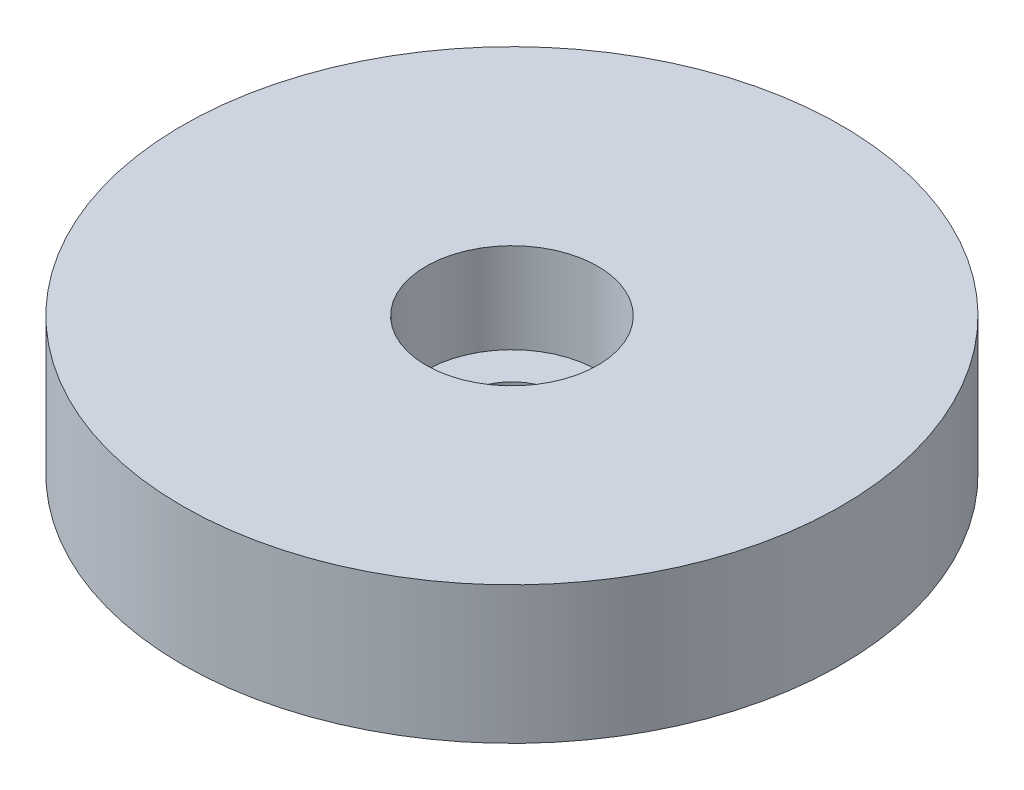
ISO-10303-21;
HEADER;
FILE_DESCRIPTION(('STEP AP214'),'2;1');
FILE_NAME('part.step','',(''),(''),'','','');
FILE_SCHEMA(('AUTOMOTIVE_DESIGN { 1 0 10303 214 1 1 1 1 }'));
ENDSEC;
DATA;
#1=APPLICATION_CONTEXT('core data for automotive mechanical design processes');
#2=APPLICATION_PROTOCOL_DEFINITION('international standard','automotive_design',2000,#1);
#3=PRODUCT_CONTEXT('',#1,'mechanical');
#4=PRODUCT('Part','Part','',(#3));
#5=PRODUCT_RELATED_PRODUCT_CATEGORY('part','',(#4));
#6=PRODUCT_DEFINITION_FORMATION('','',#4);
#7=PRODUCT_DEFINITION_CONTEXT('part definition',#1,'design');
#8=PRODUCT_DEFINITION('design','',#6,#7);
#9=PRODUCT_DEFINITION_SHAPE('','',#8);
#10=(LENGTH_UNIT() NAMED_UNIT(*) SI_UNIT(.MILLI.,.METRE.));
#11=(NAMED_UNIT(*) PLANE_ANGLE_UNIT() SI_UNIT($,.RADIAN.));
#12=(NAMED_UNIT(*) SI_UNIT($,.STERADIAN.) SOLID_ANGLE_UNIT());
#13=UNCERTAINTY_MEASURE_WITH_UNIT(LENGTH_MEASURE(1.E-05),#10,'distance_accuracy_value','');
#14=(GEOMETRIC_REPRESENTATION_CONTEXT(3) GLOBAL_UNCERTAINTY_ASSIGNED_CONTEXT((#13)) GLOBAL_UNIT_ASSIGNED_CONTEXT((#10,
#11,#12)) REPRESENTATION_CONTEXT('',''));
#15=CARTESIAN_POINT('',(0.,0.,0.));
#16=DIRECTION('',(0.,0.,1.));
#17=DIRECTION('',(1.,0.,0.));
#18=AXIS2_PLACEMENT_3D('',#15,#16,#17);
#19=CARTESIAN_POINT('',(0.,6.35,0.));
#20=DIRECTION('',(0.,-1.,0.));
#21=DIRECTION('',(0.,0.,-1.));
#22=AXIS2_PLACEMENT_3D('',#19,#20,#21);
#23=CYLINDRICAL_SURFACE('',#22,15.24);
#24=CARTESIAN_POINT('',(0.,6.35,0.));
#25=DIRECTION('',(0.,1.,0.));
#26=DIRECTION('',(0.,0.,1.));
#27=AXIS2_PLACEMENT_3D('',#24,#25,#26);
#28=CIRCLE('',#27,15.24);
#29=CARTESIAN_POINT('',(0.,6.35,15.24));
#30=VERTEX_POINT('',#29);
#31=EDGE_CURVE('E10',#30,#30,#28,.T.);
#32=ORIENTED_EDGE('',*,*,#31,.F.);
#33=EDGE_LOOP('',(#32));
#34=FACE_BOUND('',#33,.T.);
#35=CARTESIAN_POINT('',(0.,0.,0.));
#36=DIRECTION('',(0.,1.,0.));
#37=DIRECTION('',(0.,0.,1.));
#38=AXIS2_PLACEMENT_3D('',#35,#36,#37);
#39=CIRCLE('',#38,15.24);
#40=CARTESIAN_POINT('',(0.,0.,15.24));
#41=VERTEX_POINT('',#40);
#42=EDGE_CURVE('E33',#41,#41,#39,.T.);
#43=ORIENTED_EDGE('',*,*,#42,.T.);
#44=EDGE_LOOP('',(#43));
#45=FACE_BOUND('',#44,.T.);
#46=ADVANCED_FACE('F30',(#34,#45),#23,.T.);
#47=CARTESIAN_POINT('',(0.,6.35,0.));
#48=DIRECTION('',(0.,1.,0.));
#49=DIRECTION('',(0.,0.,1.));
#50=AXIS2_PLACEMENT_3D('',#47,#48,#49);
#51=PLANE('',#50);
#52=CARTESIAN_POINT('',(0.,6.35,0.));
#53=DIRECTION('',(0.,1.,0.));
#54=DIRECTION('',(0.,0.,1.));
#55=AXIS2_PLACEMENT_3D('',#52,#53,#54);
#56=CIRCLE('',#55,3.96875);
#57=CARTESIAN_POINT('',(0.,6.35,3.96875));
#58=VERTEX_POINT('',#57);
#59=EDGE_CURVE('E50',#58,#58,#56,.T.);
#60=ORIENTED_EDGE('',*,*,#59,.F.);
#61=EDGE_LOOP('',(#60));
#62=FACE_BOUND('',#61,.T.);
#63=ORIENTED_EDGE('',*,*,#31,.T.);
#64=EDGE_LOOP('',(#63));
#65=FACE_BOUND('',#64,.T.);
#66=ADVANCED_FACE('F56',(#62,#65),#51,.T.);
#67=CARTESIAN_POINT('',(0.,0.,0.));
#68=DIRECTION('',(0.,1.,0.));
#69=DIRECTION('',(0.,0.,1.));
#70=AXIS2_PLACEMENT_3D('',#67,#68,#69);
#71=PLANE('',#70);
#72=CARTESIAN_POINT('',(0.,0.,0.));
#73=DIRECTION('',(0.,1.,0.));
#74=DIRECTION('',(0.,0.,1.));
#75=AXIS2_PLACEMENT_3D('',#72,#73,#74);
#76=CIRCLE('',#75,2.15265);
#77=CARTESIAN_POINT('',(0.,0.,2.15265));
#78=VERTEX_POINT('',#77);
#79=EDGE_CURVE('E40',#78,#78,#76,.T.);
#80=ORIENTED_EDGE('',*,*,#79,.T.);
#81=EDGE_LOOP('',(#80));
#82=FACE_BOUND('',#81,.T.);
#83=ORIENTED_EDGE('',*,*,#42,.F.);
#84=EDGE_LOOP('',(#83));
#85=FACE_BOUND('',#84,.T.);
#86=ADVANCED_FACE('F58',(#82,#85),#71,.F.);
#87=CARTESIAN_POINT('',(0.,6.35,0.));
#88=DIRECTION('',(0.,1.,0.));
#89=DIRECTION('',(0.,0.,1.));
#90=AXIS2_PLACEMENT_3D('',#87,#88,#89);
#91=CYLINDRICAL_SURFACE('',#90,2.15265);
#92=ORIENTED_EDGE('',*,*,#79,.F.);
#93=EDGE_LOOP('',(#92));
#94=FACE_BOUND('',#93,.T.);
#95=CARTESIAN_POINT('',(0.,2.1844,0.));
#96=DIRECTION('',(0.,1.,0.));
#97=DIRECTION('',(0.,0.,1.));
#98=AXIS2_PLACEMENT_3D('',#95,#96,#97);
#99=CIRCLE('',#98,2.15265);
#100=CARTESIAN_POINT('',(0.,2.1844,2.15265));
#101=VERTEX_POINT('',#100);
#102=EDGE_CURVE('E44',#101,#101,#99,.T.);
#103=ORIENTED_EDGE('',*,*,#102,.T.);
#104=EDGE_LOOP('',(#103));
#105=FACE_BOUND('',#104,.T.);
#106=ADVANCED_FACE('F64',(#94,#105),#91,.F.);
#107=CARTESIAN_POINT('',(2.15265,2.1844,0.));
#108=DIRECTION('',(0.,-1.,0.));
#109=DIRECTION('',(0.,0.,-1.));
#110=AXIS2_PLACEMENT_3D('',#107,#108,#109);
#111=PLANE('',#110);
#112=ORIENTED_EDGE('',*,*,#102,.F.);
#113=EDGE_LOOP('',(#112));
#114=FACE_BOUND('',#113,.T.);
#115=CARTESIAN_POINT('',(0.,2.1844,0.));
#116=DIRECTION('',(0.,1.,0.));
#117=DIRECTION('',(0.,0.,1.));
#118=AXIS2_PLACEMENT_3D('',#115,#116,#117);
#119=CIRCLE('',#118,3.96875);
#120=CARTESIAN_POINT('',(0.,2.1844,3.96875));
#121=VERTEX_POINT('',#120);
#122=EDGE_CURVE('E47',#121,#121,#119,.T.);
#123=ORIENTED_EDGE('',*,*,#122,.T.);
#124=EDGE_LOOP('',(#123));
#125=FACE_BOUND('',#124,.T.);
#126=ADVANCED_FACE('F70',(#114,#125),#111,.F.);
#127=CARTESIAN_POINT('',(0.,6.35,0.));
#128=DIRECTION('',(0.,1.,0.));
#129=DIRECTION('',(0.,0.,1.));
#130=AXIS2_PLACEMENT_3D('',#127,#128,#129);
#131=CYLINDRICAL_SURFACE('',#130,3.96875);
#132=ORIENTED_EDGE('',*,*,#122,.F.);
#133=EDGE_LOOP('',(#132));
#134=FACE_BOUND('',#133,.T.);
#135=ORIENTED_EDGE('',*,*,#59,.T.);
#136=EDGE_LOOP('',(#135));
#137=FACE_BOUND('',#136,.T.);
#138=ADVANCED_FACE('F54',(#134,#137),#131,.F.);
#139=CLOSED_SHELL('',(#46,#66,#86,#106,#126,#138));
#140=MANIFOLD_SOLID_BREP('B2',#139);
#141=ADVANCED_BREP_SHAPE_REPRESENTATION('',(#18,#140),#14);
#142=SHAPE_DEFINITION_REPRESENTATION(#9,#141);
ENDSEC;
END-ISO-10303-21;
